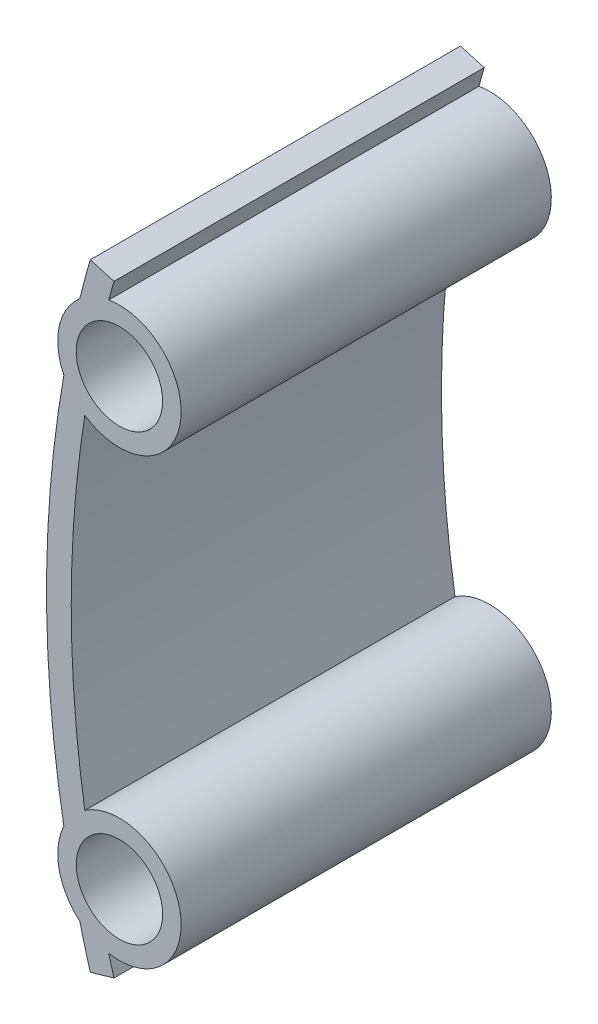
ISO-10303-21;
HEADER;
FILE_DESCRIPTION(('STEP AP214'),'2;1');
FILE_NAME('part.step','',(''),(''),'','','');
FILE_SCHEMA(('AUTOMOTIVE_DESIGN { 1 0 10303 214 1 1 1 1 }'));
ENDSEC;
DATA;
#1=APPLICATION_CONTEXT('core data for automotive mechanical design processes');
#2=APPLICATION_PROTOCOL_DEFINITION('international standard','automotive_design',2000,#1);
#3=PRODUCT_CONTEXT('',#1,'mechanical');
#4=PRODUCT('Part','Part','',(#3));
#5=PRODUCT_RELATED_PRODUCT_CATEGORY('part','',(#4));
#6=PRODUCT_DEFINITION_FORMATION('','',#4);
#7=PRODUCT_DEFINITION_CONTEXT('part definition',#1,'design');
#8=PRODUCT_DEFINITION('design','',#6,#7);
#9=PRODUCT_DEFINITION_SHAPE('','',#8);
#10=(LENGTH_UNIT() NAMED_UNIT(*) SI_UNIT(.MILLI.,.METRE.));
#11=(NAMED_UNIT(*) PLANE_ANGLE_UNIT() SI_UNIT($,.RADIAN.));
#12=(NAMED_UNIT(*) SI_UNIT($,.STERADIAN.) SOLID_ANGLE_UNIT());
#13=UNCERTAINTY_MEASURE_WITH_UNIT(LENGTH_MEASURE(1.E-05),#10,'distance_accuracy_value','');
#14=(GEOMETRIC_REPRESENTATION_CONTEXT(3) GLOBAL_UNCERTAINTY_ASSIGNED_CONTEXT((#13)) GLOBAL_UNIT_ASSIGNED_CONTEXT((#10,
#11,#12)) REPRESENTATION_CONTEXT('',''));
#15=CARTESIAN_POINT('',(0.,0.,0.));
#16=DIRECTION('',(0.,0.,1.));
#17=DIRECTION('',(1.,0.,0.));
#18=AXIS2_PLACEMENT_3D('',#15,#16,#17);
#19=CARTESIAN_POINT('',(90.,0.,30.));
#20=DIRECTION('',(0.,0.,1.));
#21=DIRECTION('',(1.,0.,0.));
#22=AXIS2_PLACEMENT_3D('',#19,#20,#21);
#23=PLANE('',#22);
#24=CARTESIAN_POINT('',(5.90481583348546,-18.,30.));
#25=DIRECTION('',(0.,0.,1.));
#26=DIRECTION('',(1.,0.,0.));
#27=AXIS2_PLACEMENT_3D('',#24,#25,#26);
#28=CIRCLE('',#27,3.5);
#29=CARTESIAN_POINT('',(9.40481583348545,-18.,30.));
#30=VERTEX_POINT('',#29);
#31=EDGE_CURVE('E162',#30,#30,#28,.T.);
#32=ORIENTED_EDGE('',*,*,#31,.F.);
#33=EDGE_LOOP('',(#32));
#34=FACE_BOUND('',#33,.T.);
#35=CARTESIAN_POINT('',(90.,0.,30.));
#36=DIRECTION('',(0.,0.,1.));
#37=DIRECTION('',(1.,0.,0.));
#38=AXIS2_PLACEMENT_3D('',#35,#36,#37);
#39=CIRCLE('',#38,90.);
#40=CARTESIAN_POINT('',(3.54191767104708,25.,30.));
#41=VERTEX_POINT('',#40);
#42=CARTESIAN_POINT('',(2.68682867485382,21.8268209582997,30.));
#43=VERTEX_POINT('',#42);
#44=EDGE_CURVE('E181',#41,#43,#39,.T.);
#45=ORIENTED_EDGE('',*,*,#44,.T.);
#46=CARTESIAN_POINT('',(5.90481583348546,18.,30.));
#47=DIRECTION('',(0.,0.,1.));
#48=DIRECTION('',(1.,0.,0.));
#49=AXIS2_PLACEMENT_3D('',#46,#47,#48);
#50=CIRCLE('',#49,5.);
#51=CARTESIAN_POINT('',(1.40232840462878,15.8256939146046,30.));
#52=VERTEX_POINT('',#51);
#53=EDGE_CURVE('E109',#43,#52,#50,.T.);
#54=ORIENTED_EDGE('',*,*,#53,.T.);
#55=CARTESIAN_POINT('',(90.,0.,30.));
#56=DIRECTION('',(0.,0.,1.));
#57=DIRECTION('',(1.,0.,0.));
#58=AXIS2_PLACEMENT_3D('',#55,#56,#57);
#59=CIRCLE('',#58,90.);
#60=CARTESIAN_POINT('',(1.40232840462878,-15.8256939146046,30.));
#61=VERTEX_POINT('',#60);
#62=EDGE_CURVE('E208',#52,#61,#59,.T.);
#63=ORIENTED_EDGE('',*,*,#62,.T.);
#64=CARTESIAN_POINT('',(5.90481583348546,-18.,30.));
#65=DIRECTION('',(0.,0.,1.));
#66=DIRECTION('',(1.,0.,0.));
#67=AXIS2_PLACEMENT_3D('',#64,#65,#66);
#68=CIRCLE('',#67,5.);
#69=CARTESIAN_POINT('',(2.68682867485381,-21.8268209582997,30.));
#70=VERTEX_POINT('',#69);
#71=EDGE_CURVE('E227',#61,#70,#68,.T.);
#72=ORIENTED_EDGE('',*,*,#71,.T.);
#73=CARTESIAN_POINT('',(90.,0.,30.));
#74=DIRECTION('',(0.,0.,1.));
#75=DIRECTION('',(1.,0.,0.));
#76=AXIS2_PLACEMENT_3D('',#73,#74,#75);
#77=CIRCLE('',#76,90.);
#78=CARTESIAN_POINT('',(3.54191767104708,-25.,30.));
#79=VERTEX_POINT('',#78);
#80=EDGE_CURVE('E224',#70,#79,#77,.T.);
#81=ORIENTED_EDGE('',*,*,#80,.T.);
#82=DIRECTION('',(0.960645359210587,0.27777777777778,0.));
#83=VECTOR('',#82,1.);
#84=CARTESIAN_POINT('',(3.54191767104708,-25.,30.));
#85=LINE('',#84,#83);
#86=CARTESIAN_POINT('',(5.46320838946823,-24.4444444444444,30.));
#87=VERTEX_POINT('',#86);
#88=EDGE_CURVE('E226',#79,#87,#85,.T.);
#89=ORIENTED_EDGE('',*,*,#88,.T.);
#90=CARTESIAN_POINT('',(90.,0.,30.));
#91=DIRECTION('',(0.,0.,-1.));
#92=DIRECTION('',(1.,0.,0.));
#93=AXIS2_PLACEMENT_3D('',#90,#91,#92);
#94=CIRCLE('',#93,88.);
#95=CARTESIAN_POINT('',(5.03839855540288,-22.9243599685888,30.));
#96=VERTEX_POINT('',#95);
#97=EDGE_CURVE('E229',#87,#96,#94,.T.);
#98=ORIENTED_EDGE('',*,*,#97,.T.);
#99=CARTESIAN_POINT('',(5.90481583348546,-18.,30.));
#100=DIRECTION('',(0.,0.,1.));
#101=DIRECTION('',(1.,0.,0.));
#102=AXIS2_PLACEMENT_3D('',#99,#100,#101);
#103=CIRCLE('',#102,5.00000000000001);
#104=CARTESIAN_POINT('',(3.09860676140783,-13.8617406263273,30.));
#105=VERTEX_POINT('',#104);
#106=EDGE_CURVE('E235',#96,#105,#103,.T.);
#107=ORIENTED_EDGE('',*,*,#106,.T.);
#108=CARTESIAN_POINT('',(90.,0.,30.));
#109=DIRECTION('',(0.,0.,-1.));
#110=DIRECTION('',(1.,0.,0.));
#111=AXIS2_PLACEMENT_3D('',#108,#109,#110);
#112=CIRCLE('',#111,88.);
#113=CARTESIAN_POINT('',(3.09860676140784,13.8617406263274,30.));
#114=VERTEX_POINT('',#113);
#115=EDGE_CURVE('E140',#105,#114,#112,.T.);
#116=ORIENTED_EDGE('',*,*,#115,.T.);
#117=CARTESIAN_POINT('',(5.90481583348546,18.,30.));
#118=DIRECTION('',(0.,0.,1.));
#119=DIRECTION('',(1.,0.,0.));
#120=AXIS2_PLACEMENT_3D('',#117,#118,#119);
#121=CIRCLE('',#120,5.00000000000001);
#122=CARTESIAN_POINT('',(5.03839855540288,22.9243599685888,30.));
#123=VERTEX_POINT('',#122);
#124=EDGE_CURVE('E134',#114,#123,#121,.T.);
#125=ORIENTED_EDGE('',*,*,#124,.T.);
#126=CARTESIAN_POINT('',(90.,0.,30.));
#127=DIRECTION('',(0.,0.,-1.));
#128=DIRECTION('',(1.,0.,0.));
#129=AXIS2_PLACEMENT_3D('',#126,#127,#128);
#130=CIRCLE('',#129,88.);
#131=CARTESIAN_POINT('',(5.46320838946826,24.4444444444444,30.));
#132=VERTEX_POINT('',#131);
#133=EDGE_CURVE('E138',#123,#132,#130,.T.);
#134=ORIENTED_EDGE('',*,*,#133,.T.);
#135=DIRECTION('',(-0.960645359210587,0.27777777777778,0.));
#136=VECTOR('',#135,1.);
#137=CARTESIAN_POINT('',(3.54191767104708,25.,30.));
#138=LINE('',#137,#136);
#139=EDGE_CURVE('E54',#132,#41,#138,.T.);
#140=ORIENTED_EDGE('',*,*,#139,.T.);
#141=EDGE_LOOP('',(#45,#54,#63,#72,#81,#89,#98,#107,#116,#125,#134,#140));
#142=FACE_BOUND('',#141,.T.);
#143=CARTESIAN_POINT('',(5.90481583348546,18.,30.));
#144=DIRECTION('',(0.,0.,1.));
#145=DIRECTION('',(1.,0.,0.));
#146=AXIS2_PLACEMENT_3D('',#143,#144,#145);
#147=CIRCLE('',#146,3.5);
#148=CARTESIAN_POINT('',(9.40481583348545,18.,30.));
#149=VERTEX_POINT('',#148);
#150=EDGE_CURVE('E277',#149,#149,#147,.T.);
#151=ORIENTED_EDGE('',*,*,#150,.F.);
#152=EDGE_LOOP('',(#151));
#153=FACE_BOUND('',#152,.T.);
#154=ADVANCED_FACE('F37',(#34,#142,#153),#23,.T.);
#155=CARTESIAN_POINT('',(90.,0.,0.));
#156=DIRECTION('',(0.,0.,1.));
#157=DIRECTION('',(1.,0.,0.));
#158=AXIS2_PLACEMENT_3D('',#155,#156,#157);
#159=PLANE('',#158);
#160=CARTESIAN_POINT('',(90.,0.,0.));
#161=DIRECTION('',(0.,0.,1.));
#162=DIRECTION('',(1.,0.,0.));
#163=AXIS2_PLACEMENT_3D('',#160,#161,#162);
#164=CIRCLE('',#163,90.);
#165=CARTESIAN_POINT('',(3.54191767104708,25.,0.));
#166=VERTEX_POINT('',#165);
#167=CARTESIAN_POINT('',(2.68682867485382,21.8268209582997,0.));
#168=VERTEX_POINT('',#167);
#169=EDGE_CURVE('E158',#166,#168,#164,.T.);
#170=ORIENTED_EDGE('',*,*,#169,.F.);
#171=DIRECTION('',(-0.960645359210587,0.27777777777778,0.));
#172=VECTOR('',#171,1.);
#173=CARTESIAN_POINT('',(3.54191767104708,25.,0.));
#174=LINE('',#173,#172);
#175=CARTESIAN_POINT('',(5.46320838946826,24.4444444444444,0.));
#176=VERTEX_POINT('',#175);
#177=EDGE_CURVE('E101',#176,#166,#174,.T.);
#178=ORIENTED_EDGE('',*,*,#177,.F.);
#179=CARTESIAN_POINT('',(90.,0.,0.));
#180=DIRECTION('',(0.,0.,-1.));
#181=DIRECTION('',(1.,0.,0.));
#182=AXIS2_PLACEMENT_3D('',#179,#180,#181);
#183=CIRCLE('',#182,88.);
#184=CARTESIAN_POINT('',(5.03839855540288,22.9243599685888,0.));
#185=VERTEX_POINT('',#184);
#186=EDGE_CURVE('E95',#185,#176,#183,.T.);
#187=ORIENTED_EDGE('',*,*,#186,.F.);
#188=CARTESIAN_POINT('',(5.90481583348546,18.,0.));
#189=DIRECTION('',(0.,0.,1.));
#190=DIRECTION('',(1.,0.,0.));
#191=AXIS2_PLACEMENT_3D('',#188,#189,#190);
#192=CIRCLE('',#191,5.00000000000001);
#193=CARTESIAN_POINT('',(3.09860676140784,13.8617406263274,0.));
#194=VERTEX_POINT('',#193);
#195=EDGE_CURVE('E148',#194,#185,#192,.T.);
#196=ORIENTED_EDGE('',*,*,#195,.F.);
#197=CARTESIAN_POINT('',(90.,0.,0.));
#198=DIRECTION('',(0.,0.,-1.));
#199=DIRECTION('',(1.,0.,0.));
#200=AXIS2_PLACEMENT_3D('',#197,#198,#199);
#201=CIRCLE('',#200,88.);
#202=CARTESIAN_POINT('',(3.09860676140783,-13.8617406263273,0.));
#203=VERTEX_POINT('',#202);
#204=EDGE_CURVE('E176',#203,#194,#201,.T.);
#205=ORIENTED_EDGE('',*,*,#204,.F.);
#206=CARTESIAN_POINT('',(5.90481583348546,-18.,0.));
#207=DIRECTION('',(0.,0.,1.));
#208=DIRECTION('',(1.,0.,0.));
#209=AXIS2_PLACEMENT_3D('',#206,#207,#208);
#210=CIRCLE('',#209,5.00000000000001);
#211=CARTESIAN_POINT('',(5.03839855540288,-22.9243599685888,0.));
#212=VERTEX_POINT('',#211);
#213=EDGE_CURVE('E174',#212,#203,#210,.T.);
#214=ORIENTED_EDGE('',*,*,#213,.F.);
#215=CARTESIAN_POINT('',(90.,0.,0.));
#216=DIRECTION('',(0.,0.,-1.));
#217=DIRECTION('',(1.,0.,0.));
#218=AXIS2_PLACEMENT_3D('',#215,#216,#217);
#219=CIRCLE('',#218,88.);
#220=CARTESIAN_POINT('',(5.46320838946823,-24.4444444444444,0.));
#221=VERTEX_POINT('',#220);
#222=EDGE_CURVE('E172',#221,#212,#219,.T.);
#223=ORIENTED_EDGE('',*,*,#222,.F.);
#224=DIRECTION('',(0.960645359210587,0.27777777777778,0.));
#225=VECTOR('',#224,1.);
#226=CARTESIAN_POINT('',(3.54191767104708,-25.,0.));
#227=LINE('',#226,#225);
#228=CARTESIAN_POINT('',(3.54191767104708,-25.,0.));
#229=VERTEX_POINT('',#228);
#230=EDGE_CURVE('E170',#229,#221,#227,.T.);
#231=ORIENTED_EDGE('',*,*,#230,.F.);
#232=CARTESIAN_POINT('',(90.,0.,0.));
#233=DIRECTION('',(0.,0.,1.));
#234=DIRECTION('',(1.,0.,0.));
#235=AXIS2_PLACEMENT_3D('',#232,#233,#234);
#236=CIRCLE('',#235,90.);
#237=CARTESIAN_POINT('',(2.68682867485381,-21.8268209582997,0.));
#238=VERTEX_POINT('',#237);
#239=EDGE_CURVE('E168',#238,#229,#236,.T.);
#240=ORIENTED_EDGE('',*,*,#239,.F.);
#241=CARTESIAN_POINT('',(5.90481583348546,-18.,0.));
#242=DIRECTION('',(0.,0.,1.));
#243=DIRECTION('',(1.,0.,0.));
#244=AXIS2_PLACEMENT_3D('',#241,#242,#243);
#245=CIRCLE('',#244,5.);
#246=CARTESIAN_POINT('',(1.40232840462878,-15.8256939146046,0.));
#247=VERTEX_POINT('',#246);
#248=EDGE_CURVE('E166',#247,#238,#245,.T.);
#249=ORIENTED_EDGE('',*,*,#248,.F.);
#250=CARTESIAN_POINT('',(90.,0.,0.));
#251=DIRECTION('',(0.,0.,1.));
#252=DIRECTION('',(1.,0.,0.));
#253=AXIS2_PLACEMENT_3D('',#250,#251,#252);
#254=CIRCLE('',#253,90.);
#255=CARTESIAN_POINT('',(1.40232840462878,15.8256939146046,0.));
#256=VERTEX_POINT('',#255);
#257=EDGE_CURVE('E164',#256,#247,#254,.T.);
#258=ORIENTED_EDGE('',*,*,#257,.F.);
#259=CARTESIAN_POINT('',(5.90481583348546,18.,0.));
#260=DIRECTION('',(0.,0.,1.));
#261=DIRECTION('',(1.,0.,0.));
#262=AXIS2_PLACEMENT_3D('',#259,#260,#261);
#263=CIRCLE('',#262,5.);
#264=EDGE_CURVE('E161',#168,#256,#263,.T.);
#265=ORIENTED_EDGE('',*,*,#264,.F.);
#266=EDGE_LOOP('',(#170,#178,#187,#196,#205,#214,#223,#231,#240,#249,#258,#265));
#267=FACE_BOUND('',#266,.T.);
#268=CARTESIAN_POINT('',(5.90481583348546,-18.,0.));
#269=DIRECTION('',(0.,0.,1.));
#270=DIRECTION('',(1.,0.,0.));
#271=AXIS2_PLACEMENT_3D('',#268,#269,#270);
#272=CIRCLE('',#271,3.5);
#273=CARTESIAN_POINT('',(9.40481583348545,-18.,0.));
#274=VERTEX_POINT('',#273);
#275=EDGE_CURVE('E283',#274,#274,#272,.T.);
#276=ORIENTED_EDGE('',*,*,#275,.T.);
#277=EDGE_LOOP('',(#276));
#278=FACE_BOUND('',#277,.T.);
#279=CARTESIAN_POINT('',(5.90481583348546,18.,0.));
#280=DIRECTION('',(0.,0.,1.));
#281=DIRECTION('',(1.,0.,0.));
#282=AXIS2_PLACEMENT_3D('',#279,#280,#281);
#283=CIRCLE('',#282,3.5);
#284=CARTESIAN_POINT('',(9.40481583348545,18.,0.));
#285=VERTEX_POINT('',#284);
#286=EDGE_CURVE('E280',#285,#285,#283,.T.);
#287=ORIENTED_EDGE('',*,*,#286,.T.);
#288=EDGE_LOOP('',(#287));
#289=FACE_BOUND('',#288,.T.);
#290=ADVANCED_FACE('F212',(#267,#278,#289),#159,.F.);
#291=CARTESIAN_POINT('',(90.,0.,30.));
#292=DIRECTION('',(0.,0.,-1.));
#293=DIRECTION('',(-1.,0.,0.));
#294=AXIS2_PLACEMENT_3D('',#291,#292,#293);
#295=CYLINDRICAL_SURFACE('',#294,90.);
#296=ORIENTED_EDGE('',*,*,#169,.T.);
#297=DIRECTION('',(0.,0.,-1.));
#298=VECTOR('',#297,1.);
#299=CARTESIAN_POINT('',(2.68682867485382,21.8268209582997,30.));
#300=LINE('',#299,#298);
#301=EDGE_CURVE('E11',#43,#168,#300,.T.);
#302=ORIENTED_EDGE('',*,*,#301,.F.);
#303=ORIENTED_EDGE('',*,*,#44,.F.);
#304=DIRECTION('',(0.,0.,-1.));
#305=VECTOR('',#304,1.);
#306=CARTESIAN_POINT('',(3.54191767104708,25.,30.));
#307=LINE('',#306,#305);
#308=EDGE_CURVE('E154',#41,#166,#307,.T.);
#309=ORIENTED_EDGE('',*,*,#308,.T.);
#310=EDGE_LOOP('',(#296,#302,#303,#309));
#311=FACE_BOUND('',#310,.T.);
#312=ADVANCED_FACE('F39',(#311),#295,.T.);
#313=CARTESIAN_POINT('',(5.90481583348546,18.,30.));
#314=DIRECTION('',(0.,0.,-1.));
#315=DIRECTION('',(-1.,0.,0.));
#316=AXIS2_PLACEMENT_3D('',#313,#314,#315);
#317=CYLINDRICAL_SURFACE('',#316,5.);
#318=ORIENTED_EDGE('',*,*,#264,.T.);
#319=DIRECTION('',(0.,0.,-1.));
#320=VECTOR('',#319,1.);
#321=CARTESIAN_POINT('',(1.40232840462878,15.8256939146046,30.));
#322=LINE('',#321,#320);
#323=EDGE_CURVE('E46',#52,#256,#322,.T.);
#324=ORIENTED_EDGE('',*,*,#323,.F.);
#325=ORIENTED_EDGE('',*,*,#53,.F.);
#326=ORIENTED_EDGE('',*,*,#301,.T.);
#327=EDGE_LOOP('',(#318,#324,#325,#326));
#328=FACE_BOUND('',#327,.T.);
#329=ADVANCED_FACE('F386',(#328),#317,.T.);
#330=CARTESIAN_POINT('',(90.,0.,30.));
#331=DIRECTION('',(0.,0.,-1.));
#332=DIRECTION('',(-1.,0.,0.));
#333=AXIS2_PLACEMENT_3D('',#330,#331,#332);
#334=CYLINDRICAL_SURFACE('',#333,90.);
#335=ORIENTED_EDGE('',*,*,#257,.T.);
#336=DIRECTION('',(0.,0.,-1.));
#337=VECTOR('',#336,1.);
#338=CARTESIAN_POINT('',(1.40232840462878,-15.8256939146046,30.));
#339=LINE('',#338,#337);
#340=EDGE_CURVE('E200',#61,#247,#339,.T.);
#341=ORIENTED_EDGE('',*,*,#340,.F.);
#342=ORIENTED_EDGE('',*,*,#62,.F.);
#343=ORIENTED_EDGE('',*,*,#323,.T.);
#344=EDGE_LOOP('',(#335,#341,#342,#343));
#345=FACE_BOUND('',#344,.T.);
#346=ADVANCED_FACE('F206',(#345),#334,.T.);
#347=CARTESIAN_POINT('',(5.90481583348546,-18.,30.));
#348=DIRECTION('',(0.,0.,-1.));
#349=DIRECTION('',(-1.,0.,0.));
#350=AXIS2_PLACEMENT_3D('',#347,#348,#349);
#351=CYLINDRICAL_SURFACE('',#350,5.);
#352=ORIENTED_EDGE('',*,*,#248,.T.);
#353=DIRECTION('',(0.,0.,-1.));
#354=VECTOR('',#353,1.);
#355=CARTESIAN_POINT('',(2.68682867485381,-21.8268209582997,30.));
#356=LINE('',#355,#354);
#357=EDGE_CURVE('E197',#70,#238,#356,.T.);
#358=ORIENTED_EDGE('',*,*,#357,.F.);
#359=ORIENTED_EDGE('',*,*,#71,.F.);
#360=ORIENTED_EDGE('',*,*,#340,.T.);
#361=EDGE_LOOP('',(#352,#358,#359,#360));
#362=FACE_BOUND('',#361,.T.);
#363=ADVANCED_FACE('F218',(#362),#351,.T.);
#364=CARTESIAN_POINT('',(90.,0.,30.));
#365=DIRECTION('',(0.,0.,-1.));
#366=DIRECTION('',(-1.,0.,0.));
#367=AXIS2_PLACEMENT_3D('',#364,#365,#366);
#368=CYLINDRICAL_SURFACE('',#367,90.);
#369=ORIENTED_EDGE('',*,*,#239,.T.);
#370=DIRECTION('',(0.,0.,-1.));
#371=VECTOR('',#370,1.);
#372=CARTESIAN_POINT('',(3.54191767104708,-25.,30.));
#373=LINE('',#372,#371);
#374=EDGE_CURVE('E194',#79,#229,#373,.T.);
#375=ORIENTED_EDGE('',*,*,#374,.F.);
#376=ORIENTED_EDGE('',*,*,#80,.F.);
#377=ORIENTED_EDGE('',*,*,#357,.T.);
#378=EDGE_LOOP('',(#369,#375,#376,#377));
#379=FACE_BOUND('',#378,.T.);
#380=ADVANCED_FACE('F222',(#379),#368,.T.);
#381=CARTESIAN_POINT('',(3.54191767104708,-25.,30.));
#382=DIRECTION('',(-0.27777777777778,0.960645359210587,0.));
#383=DIRECTION('',(-0.960645359210588,-0.27777777777778,0.));
#384=AXIS2_PLACEMENT_3D('',#381,#382,#383);
#385=PLANE('',#384);
#386=ORIENTED_EDGE('',*,*,#230,.T.);
#387=DIRECTION('',(0.,0.,-1.));
#388=VECTOR('',#387,1.);
#389=CARTESIAN_POINT('',(5.46320838946823,-24.4444444444444,30.));
#390=LINE('',#389,#388);
#391=EDGE_CURVE('E191',#87,#221,#390,.T.);
#392=ORIENTED_EDGE('',*,*,#391,.F.);
#393=ORIENTED_EDGE('',*,*,#88,.F.);
#394=ORIENTED_EDGE('',*,*,#374,.T.);
#395=EDGE_LOOP('',(#386,#392,#393,#394));
#396=FACE_BOUND('',#395,.T.);
#397=ADVANCED_FACE('F347',(#396),#385,.F.);
#398=CARTESIAN_POINT('',(90.,0.,30.));
#399=DIRECTION('',(0.,0.,-1.));
#400=DIRECTION('',(-1.,0.,0.));
#401=AXIS2_PLACEMENT_3D('',#398,#399,#400);
#402=CYLINDRICAL_SURFACE('',#401,88.);
#403=ORIENTED_EDGE('',*,*,#222,.T.);
#404=DIRECTION('',(0.,0.,-1.));
#405=VECTOR('',#404,1.);
#406=CARTESIAN_POINT('',(5.03839855540288,-22.9243599685888,30.));
#407=LINE('',#406,#405);
#408=EDGE_CURVE('E188',#96,#212,#407,.T.);
#409=ORIENTED_EDGE('',*,*,#408,.F.);
#410=ORIENTED_EDGE('',*,*,#97,.F.);
#411=ORIENTED_EDGE('',*,*,#391,.T.);
#412=EDGE_LOOP('',(#403,#409,#410,#411));
#413=FACE_BOUND('',#412,.T.);
#414=ADVANCED_FACE('F337',(#413),#402,.F.);
#415=CARTESIAN_POINT('',(5.90481583348546,-18.,30.));
#416=DIRECTION('',(0.,0.,-1.));
#417=DIRECTION('',(-1.,0.,0.));
#418=AXIS2_PLACEMENT_3D('',#415,#416,#417);
#419=CYLINDRICAL_SURFACE('',#418,5.00000000000001);
#420=ORIENTED_EDGE('',*,*,#213,.T.);
#421=DIRECTION('',(0.,0.,-1.));
#422=VECTOR('',#421,1.);
#423=CARTESIAN_POINT('',(3.09860676140783,-13.8617406263273,30.));
#424=LINE('',#423,#422);
#425=EDGE_CURVE('E185',#105,#203,#424,.T.);
#426=ORIENTED_EDGE('',*,*,#425,.F.);
#427=ORIENTED_EDGE('',*,*,#106,.F.);
#428=ORIENTED_EDGE('',*,*,#408,.T.);
#429=EDGE_LOOP('',(#420,#426,#427,#428));
#430=FACE_BOUND('',#429,.T.);
#431=ADVANCED_FACE('F241',(#430),#419,.T.);
#432=CARTESIAN_POINT('',(90.,0.,30.));
#433=DIRECTION('',(0.,0.,-1.));
#434=DIRECTION('',(-1.,0.,0.));
#435=AXIS2_PLACEMENT_3D('',#432,#433,#434);
#436=CYLINDRICAL_SURFACE('',#435,88.);
#437=ORIENTED_EDGE('',*,*,#204,.T.);
#438=DIRECTION('',(0.,0.,-1.));
#439=VECTOR('',#438,1.);
#440=CARTESIAN_POINT('',(3.09860676140784,13.8617406263274,30.));
#441=LINE('',#440,#439);
#442=EDGE_CURVE('E149',#114,#194,#441,.T.);
#443=ORIENTED_EDGE('',*,*,#442,.F.);
#444=ORIENTED_EDGE('',*,*,#115,.F.);
#445=ORIENTED_EDGE('',*,*,#425,.T.);
#446=EDGE_LOOP('',(#437,#443,#444,#445));
#447=FACE_BOUND('',#446,.T.);
#448=ADVANCED_FACE('F245',(#447),#436,.F.);
#449=CARTESIAN_POINT('',(5.90481583348546,18.,30.));
#450=DIRECTION('',(0.,0.,-1.));
#451=DIRECTION('',(-1.,0.,0.));
#452=AXIS2_PLACEMENT_3D('',#449,#450,#451);
#453=CYLINDRICAL_SURFACE('',#452,5.00000000000001);
#454=ORIENTED_EDGE('',*,*,#195,.T.);
#455=DIRECTION('',(0.,0.,-1.));
#456=VECTOR('',#455,1.);
#457=CARTESIAN_POINT('',(5.03839855540288,22.9243599685888,30.));
#458=LINE('',#457,#456);
#459=EDGE_CURVE('E145',#123,#185,#458,.T.);
#460=ORIENTED_EDGE('',*,*,#459,.F.);
#461=ORIENTED_EDGE('',*,*,#124,.F.);
#462=ORIENTED_EDGE('',*,*,#442,.T.);
#463=EDGE_LOOP('',(#454,#460,#461,#462));
#464=FACE_BOUND('',#463,.T.);
#465=ADVANCED_FACE('F146',(#464),#453,.T.);
#466=CARTESIAN_POINT('',(90.,0.,30.));
#467=DIRECTION('',(0.,0.,-1.));
#468=DIRECTION('',(-1.,0.,0.));
#469=AXIS2_PLACEMENT_3D('',#466,#467,#468);
#470=CYLINDRICAL_SURFACE('',#469,88.);
#471=ORIENTED_EDGE('',*,*,#186,.T.);
#472=DIRECTION('',(0.,0.,-1.));
#473=VECTOR('',#472,1.);
#474=CARTESIAN_POINT('',(5.46320838946826,24.4444444444444,30.));
#475=LINE('',#474,#473);
#476=EDGE_CURVE('E150',#132,#176,#475,.T.);
#477=ORIENTED_EDGE('',*,*,#476,.F.);
#478=ORIENTED_EDGE('',*,*,#133,.F.);
#479=ORIENTED_EDGE('',*,*,#459,.T.);
#480=EDGE_LOOP('',(#471,#477,#478,#479));
#481=FACE_BOUND('',#480,.T.);
#482=ADVANCED_FACE('F152',(#481),#470,.F.);
#483=CARTESIAN_POINT('',(3.54191767104708,25.,30.));
#484=DIRECTION('',(-0.27777777777778,-0.960645359210587,0.));
#485=DIRECTION('',(0.960645359210588,-0.27777777777778,0.));
#486=AXIS2_PLACEMENT_3D('',#483,#484,#485);
#487=PLANE('',#486);
#488=ORIENTED_EDGE('',*,*,#177,.T.);
#489=ORIENTED_EDGE('',*,*,#308,.F.);
#490=ORIENTED_EDGE('',*,*,#139,.F.);
#491=ORIENTED_EDGE('',*,*,#476,.T.);
#492=EDGE_LOOP('',(#488,#489,#490,#491));
#493=FACE_BOUND('',#492,.T.);
#494=ADVANCED_FACE('F249',(#493),#487,.F.);
#495=CARTESIAN_POINT('',(5.90481583348546,-18.,30.));
#496=DIRECTION('',(0.,0.,-1.));
#497=DIRECTION('',(-1.,0.,0.));
#498=AXIS2_PLACEMENT_3D('',#495,#496,#497);
#499=CYLINDRICAL_SURFACE('',#498,3.5);
#500=ORIENTED_EDGE('',*,*,#31,.T.);
#501=EDGE_LOOP('',(#500));
#502=FACE_BOUND('',#501,.T.);
#503=ORIENTED_EDGE('',*,*,#275,.F.);
#504=EDGE_LOOP('',(#503));
#505=FACE_BOUND('',#504,.T.);
#506=ADVANCED_FACE('F251',(#502,#505),#499,.F.);
#507=CARTESIAN_POINT('',(5.90481583348546,18.,30.));
#508=DIRECTION('',(0.,0.,-1.));
#509=DIRECTION('',(-1.,0.,0.));
#510=AXIS2_PLACEMENT_3D('',#507,#508,#509);
#511=CYLINDRICAL_SURFACE('',#510,3.5);
#512=ORIENTED_EDGE('',*,*,#150,.T.);
#513=EDGE_LOOP('',(#512));
#514=FACE_BOUND('',#513,.T.);
#515=ORIENTED_EDGE('',*,*,#286,.F.);
#516=EDGE_LOOP('',(#515));
#517=FACE_BOUND('',#516,.T.);
#518=ADVANCED_FACE('F257',(#514,#517),#511,.F.);
#519=CLOSED_SHELL('',(#154,#290,#312,#329,#346,#363,#380,#397,#414,#431,#448,#465,#482,#494,
#506,#518));
#520=MANIFOLD_SOLID_BREP('B2',#519);
#521=ADVANCED_BREP_SHAPE_REPRESENTATION('',(#18,#520),#14);
#522=SHAPE_DEFINITION_REPRESENTATION(#9,#521);
ENDSEC;
END-ISO-10303-21;
